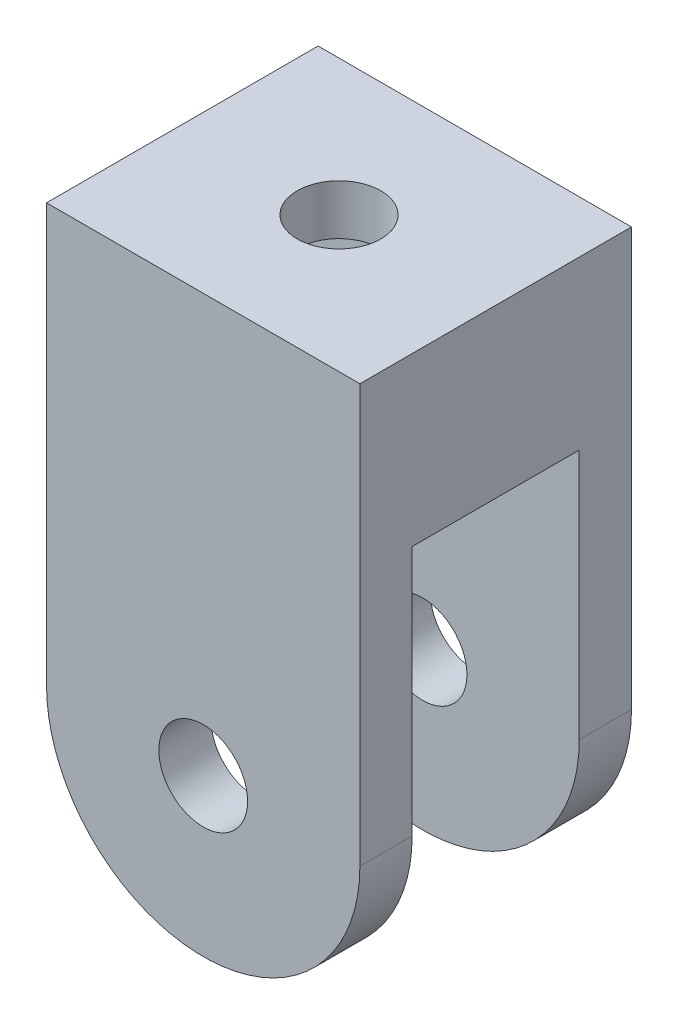
ISO-10303-21;
HEADER;
FILE_DESCRIPTION(('STEP AP214'),'2;1');
FILE_NAME('part.step','',(''),(''),'','','');
FILE_SCHEMA(('AUTOMOTIVE_DESIGN { 1 0 10303 214 1 1 1 1 }'));
ENDSEC;
DATA;
#1=APPLICATION_CONTEXT('core data for automotive mechanical design processes');
#2=APPLICATION_PROTOCOL_DEFINITION('international standard','automotive_design',2000,#1);
#3=PRODUCT_CONTEXT('',#1,'mechanical');
#4=PRODUCT('Part','Part','',(#3));
#5=PRODUCT_RELATED_PRODUCT_CATEGORY('part','',(#4));
#6=PRODUCT_DEFINITION_FORMATION('','',#4);
#7=PRODUCT_DEFINITION_CONTEXT('part definition',#1,'design');
#8=PRODUCT_DEFINITION('design','',#6,#7);
#9=PRODUCT_DEFINITION_SHAPE('','',#8);
#10=(LENGTH_UNIT() NAMED_UNIT(*) SI_UNIT(.MILLI.,.METRE.));
#11=(NAMED_UNIT(*) PLANE_ANGLE_UNIT() SI_UNIT($,.RADIAN.));
#12=(NAMED_UNIT(*) SI_UNIT($,.STERADIAN.) SOLID_ANGLE_UNIT());
#13=UNCERTAINTY_MEASURE_WITH_UNIT(LENGTH_MEASURE(1.E-05),#10,'distance_accuracy_value','');
#14=(GEOMETRIC_REPRESENTATION_CONTEXT(3) GLOBAL_UNCERTAINTY_ASSIGNED_CONTEXT((#13)) GLOBAL_UNIT_ASSIGNED_CONTEXT((#10,
#11,#12)) REPRESENTATION_CONTEXT('',''));
#15=CARTESIAN_POINT('',(0.,0.,0.));
#16=DIRECTION('',(0.,0.,1.));
#17=DIRECTION('',(1.,0.,0.));
#18=AXIS2_PLACEMENT_3D('',#15,#16,#17);
#19=CARTESIAN_POINT('',(10.,2.499,-4.));
#20=DIRECTION('',(0.,1.,0.));
#21=DIRECTION('',(-1.,0.,0.));
#22=AXIS2_PLACEMENT_3D('',#19,#20,#21);
#23=CYLINDRICAL_SURFACE('',#22,2.);
#24=CARTESIAN_POINT('',(9.99999999999999,27.6,-4.));
#25=DIRECTION('',(0.,1.,0.));
#26=DIRECTION('',(0.,0.,1.));
#27=AXIS2_PLACEMENT_3D('',#24,#25,#26);
#28=CIRCLE('',#27,2.);
#29=CARTESIAN_POINT('',(9.99999999999999,27.6,-2.));
#30=VERTEX_POINT('',#29);
#31=EDGE_CURVE('E40',#30,#30,#28,.F.);
#32=ORIENTED_EDGE('',*,*,#31,.T.);
#33=EDGE_LOOP('',(#32));
#34=FACE_BOUND('',#33,.T.);
#35=CARTESIAN_POINT('',(9.99999999999999,30.,-4.));
#36=DIRECTION('',(0.,1.,0.));
#37=DIRECTION('',(-1.,0.,0.));
#38=AXIS2_PLACEMENT_3D('',#35,#36,#37);
#39=CIRCLE('',#38,2.);
#40=CARTESIAN_POINT('',(7.99999999999999,30.,-4.));
#41=VERTEX_POINT('',#40);
#42=EDGE_CURVE('E167',#41,#41,#39,.T.);
#43=ORIENTED_EDGE('',*,*,#42,.T.);
#44=EDGE_LOOP('',(#43));
#45=FACE_BOUND('',#44,.T.);
#46=ADVANCED_FACE('F36',(#34,#45),#23,.F.);
#47=CARTESIAN_POINT('',(10.,10.,0.));
#48=DIRECTION('',(0.,0.,1.));
#49=DIRECTION('',(1.,0.,0.));
#50=AXIS2_PLACEMENT_3D('',#47,#48,#49);
#51=PLANE('',#50);
#52=CARTESIAN_POINT('',(10.,10.,0.));
#53=DIRECTION('',(0.,0.,1.));
#54=DIRECTION('',(1.,0.,0.));
#55=AXIS2_PLACEMENT_3D('',#52,#53,#54);
#56=CIRCLE('',#55,2.125);
#57=CARTESIAN_POINT('',(12.125,10.,0.));
#58=VERTEX_POINT('',#57);
#59=EDGE_CURVE('E214',#58,#58,#56,.T.);
#60=ORIENTED_EDGE('',*,*,#59,.T.);
#61=EDGE_LOOP('',(#60));
#62=FACE_BOUND('',#61,.T.);
#63=DIRECTION('',(-1.,0.,0.));
#64=VECTOR('',#63,1.);
#65=CARTESIAN_POINT('',(17.5,22.,0.));
#66=LINE('',#65,#64);
#67=CARTESIAN_POINT('',(17.5,22.,0.));
#68=VERTEX_POINT('',#67);
#69=CARTESIAN_POINT('',(2.49999999999999,22.,0.));
#70=VERTEX_POINT('',#69);
#71=EDGE_CURVE('E61',#68,#70,#66,.T.);
#72=ORIENTED_EDGE('',*,*,#71,.F.);
#73=DIRECTION('',(0.,1.,0.));
#74=VECTOR('',#73,1.);
#75=CARTESIAN_POINT('',(17.5,10.,0.));
#76=LINE('',#75,#74);
#77=CARTESIAN_POINT('',(17.5,10.,0.));
#78=VERTEX_POINT('',#77);
#79=EDGE_CURVE('E218',#78,#68,#76,.T.);
#80=ORIENTED_EDGE('',*,*,#79,.F.);
#81=CARTESIAN_POINT('',(10.,10.,0.));
#82=DIRECTION('',(0.,0.,1.));
#83=DIRECTION('',(1.,0.,0.));
#84=AXIS2_PLACEMENT_3D('',#81,#82,#83);
#85=CIRCLE('',#84,7.5);
#86=CARTESIAN_POINT('',(2.5,10.,0.));
#87=VERTEX_POINT('',#86);
#88=EDGE_CURVE('E225',#87,#78,#85,.T.);
#89=ORIENTED_EDGE('',*,*,#88,.F.);
#90=DIRECTION('',(0.,-1.,0.));
#91=VECTOR('',#90,1.);
#92=CARTESIAN_POINT('',(2.5,10.,0.));
#93=LINE('',#92,#91);
#94=EDGE_CURVE('E233',#70,#87,#93,.T.);
#95=ORIENTED_EDGE('',*,*,#94,.F.);
#96=EDGE_LOOP('',(#72,#80,#89,#95));
#97=FACE_BOUND('',#96,.T.);
#98=ADVANCED_FACE('F264',(#62,#97),#51,.F.);
#99=CARTESIAN_POINT('',(10.,10.,2.5));
#100=DIRECTION('',(0.,0.,1.));
#101=DIRECTION('',(1.,0.,0.));
#102=AXIS2_PLACEMENT_3D('',#99,#100,#101);
#103=PLANE('',#102);
#104=DIRECTION('',(0.,1.,0.));
#105=VECTOR('',#104,1.);
#106=CARTESIAN_POINT('',(17.5,10.,2.5));
#107=LINE('',#106,#105);
#108=CARTESIAN_POINT('',(17.5,10.,2.5));
#109=VERTEX_POINT('',#108);
#110=CARTESIAN_POINT('',(17.5,30.,2.5));
#111=VERTEX_POINT('',#110);
#112=EDGE_CURVE('E221',#109,#111,#107,.T.);
#113=ORIENTED_EDGE('',*,*,#112,.T.);
#114=DIRECTION('',(-1.,0.,0.));
#115=VECTOR('',#114,1.);
#116=CARTESIAN_POINT('',(2.49999999999999,30.,2.5));
#117=LINE('',#116,#115);
#118=CARTESIAN_POINT('',(2.49999999999999,30.,2.5));
#119=VERTEX_POINT('',#118);
#120=EDGE_CURVE('E224',#111,#119,#117,.T.);
#121=ORIENTED_EDGE('',*,*,#120,.T.);
#122=DIRECTION('',(0.,-1.,0.));
#123=VECTOR('',#122,1.);
#124=CARTESIAN_POINT('',(2.5,10.,2.5));
#125=LINE('',#124,#123);
#126=CARTESIAN_POINT('',(2.5,10.,2.5));
#127=VERTEX_POINT('',#126);
#128=EDGE_CURVE('E227',#119,#127,#125,.T.);
#129=ORIENTED_EDGE('',*,*,#128,.T.);
#130=CARTESIAN_POINT('',(10.,10.,2.5));
#131=DIRECTION('',(0.,0.,1.));
#132=DIRECTION('',(1.,0.,0.));
#133=AXIS2_PLACEMENT_3D('',#130,#131,#132);
#134=CIRCLE('',#133,7.5);
#135=EDGE_CURVE('E229',#127,#109,#134,.T.);
#136=ORIENTED_EDGE('',*,*,#135,.T.);
#137=EDGE_LOOP('',(#113,#121,#129,#136));
#138=FACE_BOUND('',#137,.T.);
#139=CARTESIAN_POINT('',(10.,10.,2.5));
#140=DIRECTION('',(0.,0.,1.));
#141=DIRECTION('',(1.,0.,0.));
#142=AXIS2_PLACEMENT_3D('',#139,#140,#141);
#143=CIRCLE('',#142,2.125);
#144=CARTESIAN_POINT('',(12.125,10.,2.5));
#145=VERTEX_POINT('',#144);
#146=EDGE_CURVE('E215',#145,#145,#143,.T.);
#147=ORIENTED_EDGE('',*,*,#146,.F.);
#148=EDGE_LOOP('',(#147));
#149=FACE_BOUND('',#148,.T.);
#150=ADVANCED_FACE('F268',(#138,#149),#103,.T.);
#151=CARTESIAN_POINT('',(17.5,10.,2.5));
#152=DIRECTION('',(-1.,0.,0.));
#153=DIRECTION('',(0.,0.,1.));
#154=AXIS2_PLACEMENT_3D('',#151,#152,#153);
#155=PLANE('',#154);
#156=ORIENTED_EDGE('',*,*,#79,.T.);
#157=DIRECTION('',(0.,0.,1.));
#158=VECTOR('',#157,1.);
#159=CARTESIAN_POINT('',(17.5,22.,-8.));
#160=LINE('',#159,#158);
#161=CARTESIAN_POINT('',(17.5,22.,-8.));
#162=VERTEX_POINT('',#161);
#163=EDGE_CURVE('E211',#162,#68,#160,.T.);
#164=ORIENTED_EDGE('',*,*,#163,.F.);
#165=DIRECTION('',(0.,1.,0.));
#166=VECTOR('',#165,1.);
#167=CARTESIAN_POINT('',(17.5,10.,-8.));
#168=LINE('',#167,#166);
#169=CARTESIAN_POINT('',(17.5,10.,-8.));
#170=VERTEX_POINT('',#169);
#171=EDGE_CURVE('E177',#170,#162,#168,.T.);
#172=ORIENTED_EDGE('',*,*,#171,.F.);
#173=DIRECTION('',(0.,0.,1.));
#174=VECTOR('',#173,1.);
#175=CARTESIAN_POINT('',(17.5,10.,-10.5));
#176=LINE('',#175,#174);
#177=CARTESIAN_POINT('',(17.5,10.,-10.5));
#178=VERTEX_POINT('',#177);
#179=EDGE_CURVE('E202',#178,#170,#176,.T.);
#180=ORIENTED_EDGE('',*,*,#179,.F.);
#181=DIRECTION('',(0.,1.,0.));
#182=VECTOR('',#181,1.);
#183=CARTESIAN_POINT('',(17.5,10.,-10.5));
#184=LINE('',#183,#182);
#185=CARTESIAN_POINT('',(17.5,30.,-10.5));
#186=VERTEX_POINT('',#185);
#187=EDGE_CURVE('E180',#178,#186,#184,.T.);
#188=ORIENTED_EDGE('',*,*,#187,.T.);
#189=DIRECTION('',(0.,0.,-1.));
#190=VECTOR('',#189,1.);
#191=CARTESIAN_POINT('',(17.5,30.,2.5));
#192=LINE('',#191,#190);
#193=EDGE_CURVE('E11',#111,#186,#192,.T.);
#194=ORIENTED_EDGE('',*,*,#193,.F.);
#195=ORIENTED_EDGE('',*,*,#112,.F.);
#196=DIRECTION('',(0.,0.,-1.));
#197=VECTOR('',#196,1.);
#198=CARTESIAN_POINT('',(17.5,10.,2.5));
#199=LINE('',#198,#197);
#200=EDGE_CURVE('E231',#109,#78,#199,.T.);
#201=ORIENTED_EDGE('',*,*,#200,.T.);
#202=EDGE_LOOP('',(#156,#164,#172,#180,#188,#194,#195,#201));
#203=FACE_BOUND('',#202,.T.);
#204=ADVANCED_FACE('F38',(#203),#155,.F.);
#205=CARTESIAN_POINT('',(2.49999999999999,30.,2.5));
#206=DIRECTION('',(0.,-1.,0.));
#207=DIRECTION('',(1.,0.,0.));
#208=AXIS2_PLACEMENT_3D('',#205,#206,#207);
#209=PLANE('',#208);
#210=ORIENTED_EDGE('',*,*,#42,.F.);
#211=EDGE_LOOP('',(#210));
#212=FACE_BOUND('',#211,.T.);
#213=ORIENTED_EDGE('',*,*,#193,.T.);
#214=DIRECTION('',(-1.,0.,0.));
#215=VECTOR('',#214,1.);
#216=CARTESIAN_POINT('',(2.49999999999999,30.,-10.5));
#217=LINE('',#216,#215);
#218=CARTESIAN_POINT('',(2.49999999999999,30.,-10.5));
#219=VERTEX_POINT('',#218);
#220=EDGE_CURVE('E190',#186,#219,#217,.T.);
#221=ORIENTED_EDGE('',*,*,#220,.T.);
#222=DIRECTION('',(0.,0.,-1.));
#223=VECTOR('',#222,1.);
#224=CARTESIAN_POINT('',(2.49999999999999,30.,2.5));
#225=LINE('',#224,#223);
#226=EDGE_CURVE('E45',#119,#219,#225,.T.);
#227=ORIENTED_EDGE('',*,*,#226,.F.);
#228=ORIENTED_EDGE('',*,*,#120,.F.);
#229=EDGE_LOOP('',(#213,#221,#227,#228));
#230=FACE_BOUND('',#229,.T.);
#231=ADVANCED_FACE('F305',(#212,#230),#209,.F.);
#232=CARTESIAN_POINT('',(2.5,10.,2.5));
#233=DIRECTION('',(1.,0.,0.));
#234=DIRECTION('',(0.,1.,0.));
#235=AXIS2_PLACEMENT_3D('',#232,#233,#234);
#236=PLANE('',#235);
#237=DIRECTION('',(0.,0.,1.));
#238=VECTOR('',#237,1.);
#239=CARTESIAN_POINT('',(2.49999999999999,24.35,-7.625));
#240=LINE('',#239,#238);
#241=CARTESIAN_POINT('',(2.49999999999999,24.35,-7.625));
#242=VERTEX_POINT('',#241);
#243=CARTESIAN_POINT('',(2.49999999999999,24.35,-0.374999999999999));
#244=VERTEX_POINT('',#243);
#245=EDGE_CURVE('E157',#242,#244,#240,.T.);
#246=ORIENTED_EDGE('',*,*,#245,.F.);
#247=DIRECTION('',(0.,-1.,0.));
#248=VECTOR('',#247,1.);
#249=CARTESIAN_POINT('',(2.49999999999999,27.6,-7.625));
#250=LINE('',#249,#248);
#251=CARTESIAN_POINT('',(2.49999999999999,27.6,-7.625));
#252=VERTEX_POINT('',#251);
#253=EDGE_CURVE('E53',#252,#242,#250,.T.);
#254=ORIENTED_EDGE('',*,*,#253,.F.);
#255=DIRECTION('',(0.,0.,-1.));
#256=VECTOR('',#255,1.);
#257=CARTESIAN_POINT('',(2.49999999999999,27.6,-7.625));
#258=LINE('',#257,#256);
#259=CARTESIAN_POINT('',(2.49999999999999,27.6,-0.375));
#260=VERTEX_POINT('',#259);
#261=EDGE_CURVE('E148',#260,#252,#258,.T.);
#262=ORIENTED_EDGE('',*,*,#261,.F.);
#263=DIRECTION('',(0.,1.,0.));
#264=VECTOR('',#263,1.);
#265=CARTESIAN_POINT('',(2.49999999999999,27.6,-0.375));
#266=LINE('',#265,#264);
#267=EDGE_CURVE('E151',#244,#260,#266,.T.);
#268=ORIENTED_EDGE('',*,*,#267,.F.);
#269=EDGE_LOOP('',(#246,#254,#262,#268));
#270=FACE_BOUND('',#269,.T.);
#271=ORIENTED_EDGE('',*,*,#226,.T.);
#272=DIRECTION('',(0.,-1.,0.));
#273=VECTOR('',#272,1.);
#274=CARTESIAN_POINT('',(2.5,10.,-10.5));
#275=LINE('',#274,#273);
#276=CARTESIAN_POINT('',(2.5,10.,-10.5));
#277=VERTEX_POINT('',#276);
#278=EDGE_CURVE('E187',#219,#277,#275,.T.);
#279=ORIENTED_EDGE('',*,*,#278,.T.);
#280=DIRECTION('',(0.,0.,1.));
#281=VECTOR('',#280,1.);
#282=CARTESIAN_POINT('',(2.5,10.,-10.5));
#283=LINE('',#282,#281);
#284=CARTESIAN_POINT('',(2.5,10.,-8.));
#285=VERTEX_POINT('',#284);
#286=EDGE_CURVE('E193',#277,#285,#283,.T.);
#287=ORIENTED_EDGE('',*,*,#286,.T.);
#288=DIRECTION('',(0.,-1.,0.));
#289=VECTOR('',#288,1.);
#290=CARTESIAN_POINT('',(2.5,10.,-8.));
#291=LINE('',#290,#289);
#292=CARTESIAN_POINT('',(2.5,22.,-8.));
#293=VERTEX_POINT('',#292);
#294=EDGE_CURVE('E184',#293,#285,#291,.T.);
#295=ORIENTED_EDGE('',*,*,#294,.F.);
#296=DIRECTION('',(0.,0.,1.));
#297=VECTOR('',#296,1.);
#298=CARTESIAN_POINT('',(2.49999999999999,22.,-8.));
#299=LINE('',#298,#297);
#300=EDGE_CURVE('E207',#293,#70,#299,.T.);
#301=ORIENTED_EDGE('',*,*,#300,.T.);
#302=ORIENTED_EDGE('',*,*,#94,.T.);
#303=DIRECTION('',(0.,0.,-1.));
#304=VECTOR('',#303,1.);
#305=CARTESIAN_POINT('',(2.5,10.,2.5));
#306=LINE('',#305,#304);
#307=EDGE_CURVE('E238',#127,#87,#306,.T.);
#308=ORIENTED_EDGE('',*,*,#307,.F.);
#309=ORIENTED_EDGE('',*,*,#128,.F.);
#310=EDGE_LOOP('',(#271,#279,#287,#295,#301,#302,#308,#309));
#311=FACE_BOUND('',#310,.T.);
#312=ADVANCED_FACE('F302',(#270,#311),#236,.F.);
#313=CARTESIAN_POINT('',(10.,10.,2.5));
#314=DIRECTION('',(0.,0.,-1.));
#315=DIRECTION('',(-1.,0.,0.));
#316=AXIS2_PLACEMENT_3D('',#313,#314,#315);
#317=CYLINDRICAL_SURFACE('',#316,7.5);
#318=ORIENTED_EDGE('',*,*,#88,.T.);
#319=ORIENTED_EDGE('',*,*,#200,.F.);
#320=ORIENTED_EDGE('',*,*,#135,.F.);
#321=ORIENTED_EDGE('',*,*,#307,.T.);
#322=EDGE_LOOP('',(#318,#319,#320,#321));
#323=FACE_BOUND('',#322,.T.);
#324=ADVANCED_FACE('F295',(#323),#317,.T.);
#325=CARTESIAN_POINT('',(10.,10.,2.5));
#326=DIRECTION('',(0.,0.,-1.));
#327=DIRECTION('',(-1.,0.,0.));
#328=AXIS2_PLACEMENT_3D('',#325,#326,#327);
#329=CYLINDRICAL_SURFACE('',#328,2.125);
#330=ORIENTED_EDGE('',*,*,#146,.T.);
#331=EDGE_LOOP('',(#330));
#332=FACE_BOUND('',#331,.T.);
#333=ORIENTED_EDGE('',*,*,#59,.F.);
#334=EDGE_LOOP('',(#333));
#335=FACE_BOUND('',#334,.T.);
#336=ADVANCED_FACE('F291',(#332,#335),#329,.F.);
#337=CARTESIAN_POINT('',(17.5,22.,-8.));
#338=DIRECTION('',(0.,1.,0.));
#339=DIRECTION('',(0.,0.,1.));
#340=AXIS2_PLACEMENT_3D('',#337,#338,#339);
#341=PLANE('',#340);
#342=CARTESIAN_POINT('',(10.,22.,-4.));
#343=DIRECTION('',(0.,1.,0.));
#344=DIRECTION('',(0.,0.,1.));
#345=AXIS2_PLACEMENT_3D('',#342,#343,#344);
#346=CIRCLE('',#345,2.);
#347=CARTESIAN_POINT('',(10.,22.,-2.));
#348=VERTEX_POINT('',#347);
#349=EDGE_CURVE('E170',#348,#348,#346,.F.);
#350=ORIENTED_EDGE('',*,*,#349,.F.);
#351=EDGE_LOOP('',(#350));
#352=FACE_BOUND('',#351,.T.);
#353=ORIENTED_EDGE('',*,*,#71,.T.);
#354=ORIENTED_EDGE('',*,*,#300,.F.);
#355=DIRECTION('',(-1.,0.,0.));
#356=VECTOR('',#355,1.);
#357=CARTESIAN_POINT('',(17.5,22.,-8.));
#358=LINE('',#357,#356);
#359=EDGE_CURVE('E204',#162,#293,#358,.T.);
#360=ORIENTED_EDGE('',*,*,#359,.F.);
#361=ORIENTED_EDGE('',*,*,#163,.T.);
#362=EDGE_LOOP('',(#353,#354,#360,#361));
#363=FACE_BOUND('',#362,.T.);
#364=ADVANCED_FACE('F284',(#352,#363),#341,.F.);
#365=CARTESIAN_POINT('',(10.,10.,-8.));
#366=DIRECTION('',(0.,0.,-1.));
#367=DIRECTION('',(1.,0.,0.));
#368=AXIS2_PLACEMENT_3D('',#365,#366,#367);
#369=PLANE('',#368);
#370=CARTESIAN_POINT('',(10.,10.,-8.));
#371=DIRECTION('',(0.,0.,1.));
#372=DIRECTION('',(1.,0.,0.));
#373=AXIS2_PLACEMENT_3D('',#370,#371,#372);
#374=CIRCLE('',#373,2.125);
#375=CARTESIAN_POINT('',(12.125,10.,-8.));
#376=VERTEX_POINT('',#375);
#377=EDGE_CURVE('E173',#376,#376,#374,.T.);
#378=ORIENTED_EDGE('',*,*,#377,.F.);
#379=EDGE_LOOP('',(#378));
#380=FACE_BOUND('',#379,.T.);
#381=ORIENTED_EDGE('',*,*,#171,.T.);
#382=ORIENTED_EDGE('',*,*,#359,.T.);
#383=ORIENTED_EDGE('',*,*,#294,.T.);
#384=CARTESIAN_POINT('',(10.,10.,-8.));
#385=DIRECTION('',(0.,0.,1.));
#386=DIRECTION('',(1.,0.,0.));
#387=AXIS2_PLACEMENT_3D('',#384,#385,#386);
#388=CIRCLE('',#387,7.5);
#389=EDGE_CURVE('E196',#285,#170,#388,.T.);
#390=ORIENTED_EDGE('',*,*,#389,.T.);
#391=EDGE_LOOP('',(#381,#382,#383,#390));
#392=FACE_BOUND('',#391,.T.);
#393=ADVANCED_FACE('F281',(#380,#392),#369,.F.);
#394=CARTESIAN_POINT('',(10.,10.,-10.5));
#395=DIRECTION('',(0.,0.,1.));
#396=DIRECTION('',(1.,0.,0.));
#397=AXIS2_PLACEMENT_3D('',#394,#395,#396);
#398=CYLINDRICAL_SURFACE('',#397,7.5);
#399=ORIENTED_EDGE('',*,*,#389,.F.);
#400=ORIENTED_EDGE('',*,*,#286,.F.);
#401=CARTESIAN_POINT('',(10.,10.,-10.5));
#402=DIRECTION('',(0.,0.,1.));
#403=DIRECTION('',(1.,0.,0.));
#404=AXIS2_PLACEMENT_3D('',#401,#402,#403);
#405=CIRCLE('',#404,7.5);
#406=EDGE_CURVE('E183',#277,#178,#405,.T.);
#407=ORIENTED_EDGE('',*,*,#406,.T.);
#408=ORIENTED_EDGE('',*,*,#179,.T.);
#409=EDGE_LOOP('',(#399,#400,#407,#408));
#410=FACE_BOUND('',#409,.T.);
#411=ADVANCED_FACE('F279',(#410),#398,.T.);
#412=CARTESIAN_POINT('',(10.,10.,-10.5));
#413=DIRECTION('',(0.,0.,-1.));
#414=DIRECTION('',(1.,0.,0.));
#415=AXIS2_PLACEMENT_3D('',#412,#413,#414);
#416=PLANE('',#415);
#417=CARTESIAN_POINT('',(10.,10.,-10.5));
#418=DIRECTION('',(0.,0.,1.));
#419=DIRECTION('',(1.,0.,0.));
#420=AXIS2_PLACEMENT_3D('',#417,#418,#419);
#421=CIRCLE('',#420,2.125);
#422=CARTESIAN_POINT('',(12.125,10.,-10.5));
#423=VERTEX_POINT('',#422);
#424=EDGE_CURVE('E174',#423,#423,#421,.T.);
#425=ORIENTED_EDGE('',*,*,#424,.T.);
#426=EDGE_LOOP('',(#425));
#427=FACE_BOUND('',#426,.T.);
#428=ORIENTED_EDGE('',*,*,#187,.F.);
#429=ORIENTED_EDGE('',*,*,#406,.F.);
#430=ORIENTED_EDGE('',*,*,#278,.F.);
#431=ORIENTED_EDGE('',*,*,#220,.F.);
#432=EDGE_LOOP('',(#428,#429,#430,#431));
#433=FACE_BOUND('',#432,.T.);
#434=ADVANCED_FACE('F275',(#427,#433),#416,.T.);
#435=CARTESIAN_POINT('',(10.,10.,-10.5));
#436=DIRECTION('',(0.,0.,1.));
#437=DIRECTION('',(1.,0.,0.));
#438=AXIS2_PLACEMENT_3D('',#435,#436,#437);
#439=CYLINDRICAL_SURFACE('',#438,2.125);
#440=ORIENTED_EDGE('',*,*,#424,.F.);
#441=EDGE_LOOP('',(#440));
#442=FACE_BOUND('',#441,.T.);
#443=ORIENTED_EDGE('',*,*,#377,.T.);
#444=EDGE_LOOP('',(#443));
#445=FACE_BOUND('',#444,.T.);
#446=ADVANCED_FACE('F259',(#442,#445),#439,.F.);
#447=CARTESIAN_POINT('',(10.,24.35,-4.));
#448=DIRECTION('',(0.,-1.,0.));
#449=DIRECTION('',(1.,0.,0.));
#450=AXIS2_PLACEMENT_3D('',#447,#448,#449);
#451=CIRCLE('',#450,2.);
#452=CARTESIAN_POINT('',(12.,24.35,-4.));
#453=VERTEX_POINT('',#452);
#454=EDGE_CURVE('E163',#453,#453,#451,.F.);
#455=ORIENTED_EDGE('',*,*,#454,.T.);
#456=EDGE_LOOP('',(#455));
#457=FACE_BOUND('',#456,.T.);
#458=ORIENTED_EDGE('',*,*,#349,.T.);
#459=EDGE_LOOP('',(#458));
#460=FACE_BOUND('',#459,.T.);
#461=ADVANCED_FACE('F251',(#457,#460),#23,.F.);
#462=CARTESIAN_POINT('',(14.,27.6,-7.625));
#463=DIRECTION('',(0.,1.,0.));
#464=DIRECTION('',(0.,0.,1.));
#465=AXIS2_PLACEMENT_3D('',#462,#463,#464);
#466=PLANE('',#465);
#467=ORIENTED_EDGE('',*,*,#261,.T.);
#468=DIRECTION('',(-1.,0.,0.));
#469=VECTOR('',#468,1.);
#470=CARTESIAN_POINT('',(14.,27.6,-7.625));
#471=LINE('',#470,#469);
#472=CARTESIAN_POINT('',(14.,27.6,-7.625));
#473=VERTEX_POINT('',#472);
#474=EDGE_CURVE('E161',#473,#252,#471,.T.);
#475=ORIENTED_EDGE('',*,*,#474,.F.);
#476=DIRECTION('',(0.,0.,-1.));
#477=VECTOR('',#476,1.);
#478=CARTESIAN_POINT('',(14.,27.6,-7.625));
#479=LINE('',#478,#477);
#480=CARTESIAN_POINT('',(14.,27.6,-0.375));
#481=VERTEX_POINT('',#480);
#482=EDGE_CURVE('E135',#481,#473,#479,.T.);
#483=ORIENTED_EDGE('',*,*,#482,.F.);
#484=DIRECTION('',(-1.,0.,0.));
#485=VECTOR('',#484,1.);
#486=CARTESIAN_POINT('',(14.,27.6,-0.375));
#487=LINE('',#486,#485);
#488=EDGE_CURVE('E164',#481,#260,#487,.T.);
#489=ORIENTED_EDGE('',*,*,#488,.T.);
#490=EDGE_LOOP('',(#467,#475,#483,#489));
#491=FACE_BOUND('',#490,.T.);
#492=ORIENTED_EDGE('',*,*,#31,.F.);
#493=EDGE_LOOP('',(#492));
#494=FACE_BOUND('',#493,.T.);
#495=ADVANCED_FACE('F249',(#491,#494),#466,.F.);
#496=CARTESIAN_POINT('',(14.,24.35,-7.625));
#497=DIRECTION('',(0.,-1.,0.));
#498=DIRECTION('',(1.,0.,0.));
#499=AXIS2_PLACEMENT_3D('',#496,#497,#498);
#500=PLANE('',#499);
#501=ORIENTED_EDGE('',*,*,#245,.T.);
#502=DIRECTION('',(-1.,0.,0.));
#503=VECTOR('',#502,1.);
#504=CARTESIAN_POINT('',(14.,24.35,-0.374999999999999));
#505=LINE('',#504,#503);
#506=CARTESIAN_POINT('',(14.,24.35,-0.374999999999999));
#507=VERTEX_POINT('',#506);
#508=EDGE_CURVE('E134',#507,#244,#505,.T.);
#509=ORIENTED_EDGE('',*,*,#508,.F.);
#510=DIRECTION('',(0.,0.,1.));
#511=VECTOR('',#510,1.);
#512=CARTESIAN_POINT('',(14.,24.35,-7.625));
#513=LINE('',#512,#511);
#514=CARTESIAN_POINT('',(14.,24.35,-7.625));
#515=VERTEX_POINT('',#514);
#516=EDGE_CURVE('E138',#515,#507,#513,.T.);
#517=ORIENTED_EDGE('',*,*,#516,.F.);
#518=DIRECTION('',(-1.,0.,0.));
#519=VECTOR('',#518,1.);
#520=CARTESIAN_POINT('',(14.,24.35,-7.625));
#521=LINE('',#520,#519);
#522=EDGE_CURVE('E125',#515,#242,#521,.T.);
#523=ORIENTED_EDGE('',*,*,#522,.T.);
#524=EDGE_LOOP('',(#501,#509,#517,#523));
#525=FACE_BOUND('',#524,.T.);
#526=ORIENTED_EDGE('',*,*,#454,.F.);
#527=EDGE_LOOP('',(#526));
#528=FACE_BOUND('',#527,.T.);
#529=ADVANCED_FACE('F139',(#525,#528),#500,.F.);
#530=CARTESIAN_POINT('',(14.,27.6,-7.625));
#531=DIRECTION('',(0.,0.,-1.));
#532=DIRECTION('',(0.,1.,0.));
#533=AXIS2_PLACEMENT_3D('',#530,#531,#532);
#534=PLANE('',#533);
#535=ORIENTED_EDGE('',*,*,#253,.T.);
#536=ORIENTED_EDGE('',*,*,#522,.F.);
#537=DIRECTION('',(0.,-1.,0.));
#538=VECTOR('',#537,1.);
#539=CARTESIAN_POINT('',(14.,27.6,-7.625));
#540=LINE('',#539,#538);
#541=EDGE_CURVE('E129',#473,#515,#540,.T.);
#542=ORIENTED_EDGE('',*,*,#541,.F.);
#543=ORIENTED_EDGE('',*,*,#474,.T.);
#544=EDGE_LOOP('',(#535,#536,#542,#543));
#545=FACE_BOUND('',#544,.T.);
#546=ADVANCED_FACE('F127',(#545),#534,.F.);
#547=CARTESIAN_POINT('',(14.,27.6,-0.375));
#548=DIRECTION('',(0.,0.,1.));
#549=DIRECTION('',(0.,-1.,0.));
#550=AXIS2_PLACEMENT_3D('',#547,#548,#549);
#551=PLANE('',#550);
#552=ORIENTED_EDGE('',*,*,#267,.T.);
#553=ORIENTED_EDGE('',*,*,#488,.F.);
#554=DIRECTION('',(0.,1.,0.));
#555=VECTOR('',#554,1.);
#556=CARTESIAN_POINT('',(14.,27.6,-0.375));
#557=LINE('',#556,#555);
#558=EDGE_CURVE('E144',#507,#481,#557,.T.);
#559=ORIENTED_EDGE('',*,*,#558,.F.);
#560=ORIENTED_EDGE('',*,*,#508,.T.);
#561=EDGE_LOOP('',(#552,#553,#559,#560));
#562=FACE_BOUND('',#561,.T.);
#563=ADVANCED_FACE('F402',(#562),#551,.F.);
#564=CARTESIAN_POINT('',(14.,0.,0.));
#565=DIRECTION('',(-1.,0.,0.));
#566=DIRECTION('',(0.,-1.,0.));
#567=AXIS2_PLACEMENT_3D('',#564,#565,#566);
#568=PLANE('',#567);
#569=ORIENTED_EDGE('',*,*,#541,.T.);
#570=ORIENTED_EDGE('',*,*,#516,.T.);
#571=ORIENTED_EDGE('',*,*,#558,.T.);
#572=ORIENTED_EDGE('',*,*,#482,.T.);
#573=EDGE_LOOP('',(#569,#570,#571,#572));
#574=FACE_BOUND('',#573,.T.);
#575=ADVANCED_FACE('F146',(#574),#568,.T.);
#576=CLOSED_SHELL('',(#46,#98,#150,#204,#231,#312,#324,#336,#364,#393,#411,#434,#446,#461,#495,
#529,#546,#563,#575));
#577=MANIFOLD_SOLID_BREP('B2',#576);
#578=ADVANCED_BREP_SHAPE_REPRESENTATION('',(#18,#577),#14);
#579=SHAPE_DEFINITION_REPRESENTATION(#9,#578);
ENDSEC;
END-ISO-10303-21;
